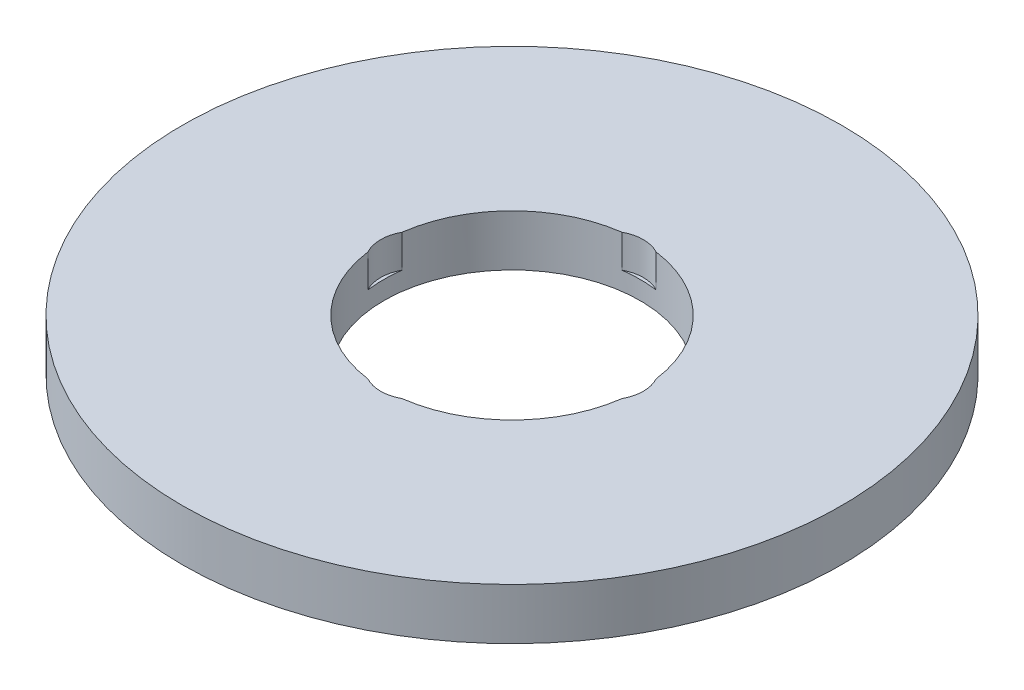
ISO-10303-21;
HEADER;
FILE_DESCRIPTION(('STEP AP214'),'2;1');
FILE_NAME('part.step','',(''),(''),'','','');
FILE_SCHEMA(('AUTOMOTIVE_DESIGN { 1 0 10303 214 1 1 1 1 }'));
ENDSEC;
DATA;
#1=APPLICATION_CONTEXT('core data for automotive mechanical design processes');
#2=APPLICATION_PROTOCOL_DEFINITION('international standard','automotive_design',2000,#1);
#3=PRODUCT_CONTEXT('',#1,'mechanical');
#4=PRODUCT('Part','Part','',(#3));
#5=PRODUCT_RELATED_PRODUCT_CATEGORY('part','',(#4));
#6=PRODUCT_DEFINITION_FORMATION('','',#4);
#7=PRODUCT_DEFINITION_CONTEXT('part definition',#1,'design');
#8=PRODUCT_DEFINITION('design','',#6,#7);
#9=PRODUCT_DEFINITION_SHAPE('','',#8);
#10=(LENGTH_UNIT() NAMED_UNIT(*) SI_UNIT(.MILLI.,.METRE.));
#11=(NAMED_UNIT(*) PLANE_ANGLE_UNIT() SI_UNIT($,.RADIAN.));
#12=(NAMED_UNIT(*) SI_UNIT($,.STERADIAN.) SOLID_ANGLE_UNIT());
#13=UNCERTAINTY_MEASURE_WITH_UNIT(LENGTH_MEASURE(1.E-05),#10,'distance_accuracy_value','');
#14=(GEOMETRIC_REPRESENTATION_CONTEXT(3) GLOBAL_UNCERTAINTY_ASSIGNED_CONTEXT((#13)) GLOBAL_UNIT_ASSIGNED_CONTEXT((#10,
#11,#12)) REPRESENTATION_CONTEXT('',''));
#15=CARTESIAN_POINT('',(0.,0.,0.));
#16=DIRECTION('',(0.,0.,1.));
#17=DIRECTION('',(1.,0.,0.));
#18=AXIS2_PLACEMENT_3D('',#15,#16,#17);
#19=CARTESIAN_POINT('',(0.,14.,0.));
#20=DIRECTION('',(0.,-1.,0.));
#21=DIRECTION('',(0.,0.,-1.));
#22=AXIS2_PLACEMENT_3D('',#19,#20,#21);
#23=CYLINDRICAL_SURFACE('',#22,90.);
#24=CARTESIAN_POINT('',(0.,14.,0.));
#25=DIRECTION('',(0.,1.,0.));
#26=DIRECTION('',(0.,0.,1.));
#27=AXIS2_PLACEMENT_3D('',#24,#25,#26);
#28=CIRCLE('',#27,90.);
#29=CARTESIAN_POINT('',(0.,14.,90.));
#30=VERTEX_POINT('',#29);
#31=EDGE_CURVE('E148',#30,#30,#28,.T.);
#32=ORIENTED_EDGE('',*,*,#31,.F.);
#33=EDGE_LOOP('',(#32));
#34=FACE_BOUND('',#33,.T.);
#35=CARTESIAN_POINT('',(0.,0.,0.));
#36=DIRECTION('',(0.,1.,0.));
#37=DIRECTION('',(0.,0.,1.));
#38=AXIS2_PLACEMENT_3D('',#35,#36,#37);
#39=CIRCLE('',#38,90.);
#40=CARTESIAN_POINT('',(0.,0.,90.));
#41=VERTEX_POINT('',#40);
#42=EDGE_CURVE('E139',#41,#41,#39,.T.);
#43=ORIENTED_EDGE('',*,*,#42,.T.);
#44=EDGE_LOOP('',(#43));
#45=FACE_BOUND('',#44,.T.);
#46=ADVANCED_FACE('F39',(#34,#45),#23,.T.);
#47=CARTESIAN_POINT('',(0.,14.,0.));
#48=DIRECTION('',(0.,1.,0.));
#49=DIRECTION('',(0.,0.,1.));
#50=AXIS2_PLACEMENT_3D('',#47,#48,#49);
#51=PLANE('',#50);
#52=CARTESIAN_POINT('',(0.,14.,25.9934029628675));
#53=DIRECTION('',(0.,1.,0.));
#54=DIRECTION('',(1.,0.,0.));
#55=AXIS2_PLACEMENT_3D('',#52,#53,#54);
#56=CIRCLE('',#55,9.87266587422507);
#57=CARTESIAN_POINT('',(-4.68158930757469,14.,34.6854828646684));
#58=VERTEX_POINT('',#57);
#59=CARTESIAN_POINT('',(4.68158930757494,14.,34.6854828646683));
#60=VERTEX_POINT('',#59);
#61=EDGE_CURVE('E175',#58,#60,#56,.T.);
#62=ORIENTED_EDGE('',*,*,#61,.F.);
#63=CARTESIAN_POINT('',(0.,14.,0.));
#64=DIRECTION('',(0.,1.,0.));
#65=DIRECTION('',(0.,0.,1.));
#66=AXIS2_PLACEMENT_3D('',#63,#64,#65);
#67=CIRCLE('',#66,35.);
#68=CARTESIAN_POINT('',(-34.6854828646684,14.,4.68158930757481));
#69=VERTEX_POINT('',#68);
#70=EDGE_CURVE('E134',#69,#58,#67,.T.);
#71=ORIENTED_EDGE('',*,*,#70,.F.);
#72=CARTESIAN_POINT('',(-25.9934029628675,14.,0.));
#73=DIRECTION('',(0.,1.,0.));
#74=DIRECTION('',(0.,0.,1.));
#75=AXIS2_PLACEMENT_3D('',#72,#73,#74);
#76=CIRCLE('',#75,9.87266587422507);
#77=CARTESIAN_POINT('',(-34.6854828646684,14.,-4.68158930757481));
#78=VERTEX_POINT('',#77);
#79=EDGE_CURVE('E143',#78,#69,#76,.T.);
#80=ORIENTED_EDGE('',*,*,#79,.F.);
#81=CARTESIAN_POINT('',(-4.68158930757518,14.,-34.6854828646683));
#82=VERTEX_POINT('',#81);
#83=EDGE_CURVE('E123',#82,#78,#67,.T.);
#84=ORIENTED_EDGE('',*,*,#83,.F.);
#85=CARTESIAN_POINT('',(-2.72266444133646E-13,14.,-25.9934029628675));
#86=DIRECTION('',(0.,1.,0.));
#87=DIRECTION('',(-1.,0.,0.));
#88=AXIS2_PLACEMENT_3D('',#85,#86,#87);
#89=CIRCLE('',#88,9.87266587422507);
#90=CARTESIAN_POINT('',(4.68158930757445,14.,-34.6854828646684));
#91=VERTEX_POINT('',#90);
#92=EDGE_CURVE('E106',#91,#82,#89,.T.);
#93=ORIENTED_EDGE('',*,*,#92,.F.);
#94=CARTESIAN_POINT('',(34.6854828646684,14.,-4.68158930757481));
#95=VERTEX_POINT('',#94);
#96=EDGE_CURVE('E125',#95,#91,#67,.T.);
#97=ORIENTED_EDGE('',*,*,#96,.F.);
#98=CARTESIAN_POINT('',(25.9934029628675,14.,0.));
#99=DIRECTION('',(0.,1.,0.));
#100=DIRECTION('',(0.,0.,-1.));
#101=AXIS2_PLACEMENT_3D('',#98,#99,#100);
#102=CIRCLE('',#101,9.87266587422507);
#103=CARTESIAN_POINT('',(34.6854828646684,14.,4.68158930757481));
#104=VERTEX_POINT('',#103);
#105=EDGE_CURVE('E286',#104,#95,#102,.T.);
#106=ORIENTED_EDGE('',*,*,#105,.F.);
#107=EDGE_CURVE('E135',#60,#104,#67,.T.);
#108=ORIENTED_EDGE('',*,*,#107,.F.);
#109=EDGE_LOOP('',(#62,#71,#80,#84,#93,#97,#106,#108));
#110=FACE_BOUND('',#109,.T.);
#111=ORIENTED_EDGE('',*,*,#31,.T.);
#112=EDGE_LOOP('',(#111));
#113=FACE_BOUND('',#112,.T.);
#114=ADVANCED_FACE('F118',(#110,#113),#51,.T.);
#115=CARTESIAN_POINT('',(0.,0.,0.));
#116=DIRECTION('',(0.,1.,0.));
#117=DIRECTION('',(0.,0.,1.));
#118=AXIS2_PLACEMENT_3D('',#115,#116,#117);
#119=PLANE('',#118);
#120=CARTESIAN_POINT('',(0.,0.,0.));
#121=DIRECTION('',(0.,1.,0.));
#122=DIRECTION('',(0.,0.,1.));
#123=AXIS2_PLACEMENT_3D('',#120,#121,#122);
#124=CIRCLE('',#123,35.);
#125=CARTESIAN_POINT('',(0.,0.,35.));
#126=VERTEX_POINT('',#125);
#127=EDGE_CURVE('E136',#126,#126,#124,.T.);
#128=ORIENTED_EDGE('',*,*,#127,.T.);
#129=EDGE_LOOP('',(#128));
#130=FACE_BOUND('',#129,.T.);
#131=ORIENTED_EDGE('',*,*,#42,.F.);
#132=EDGE_LOOP('',(#131));
#133=FACE_BOUND('',#132,.T.);
#134=ADVANCED_FACE('F187',(#130,#133),#119,.F.);
#135=CARTESIAN_POINT('',(0.,14.,0.));
#136=DIRECTION('',(0.,-1.,0.));
#137=DIRECTION('',(0.,0.,-1.));
#138=AXIS2_PLACEMENT_3D('',#135,#136,#137);
#139=CYLINDRICAL_SURFACE('',#138,35.);
#140=DIRECTION('',(0.,1.,0.));
#141=VECTOR('',#140,1.);
#142=CARTESIAN_POINT('',(-4.68158930757468,9.51405573248206,34.6854828646684));
#143=LINE('',#142,#141);
#144=CARTESIAN_POINT('',(-4.68158930757469,5.02811146496412,34.6854828646684));
#145=VERTEX_POINT('',#144);
#146=EDGE_CURVE('E11',#145,#58,#143,.T.);
#147=ORIENTED_EDGE('',*,*,#146,.F.);
#148=CARTESIAN_POINT('',(0.,5.02811146496412,0.));
#149=DIRECTION('',(0.,1.,0.));
#150=DIRECTION('',(0.,0.,1.));
#151=AXIS2_PLACEMENT_3D('',#148,#149,#150);
#152=CIRCLE('',#151,35.);
#153=CARTESIAN_POINT('',(4.68158930757494,5.02811146496412,34.6854828646683));
#154=VERTEX_POINT('',#153);
#155=EDGE_CURVE('E170',#145,#154,#152,.T.);
#156=ORIENTED_EDGE('',*,*,#155,.T.);
#157=DIRECTION('',(0.,1.,0.));
#158=VECTOR('',#157,1.);
#159=CARTESIAN_POINT('',(4.68158930757492,9.51405573248206,34.6854828646683));
#160=LINE('',#159,#158);
#161=EDGE_CURVE('E46',#60,#154,#160,.F.);
#162=ORIENTED_EDGE('',*,*,#161,.F.);
#163=ORIENTED_EDGE('',*,*,#107,.T.);
#164=DIRECTION('',(0.,1.,0.));
#165=VECTOR('',#164,1.);
#166=CARTESIAN_POINT('',(34.6854828646684,9.51405573248206,4.6815893075748));
#167=LINE('',#166,#165);
#168=CARTESIAN_POINT('',(34.6854828646684,5.02811146496412,4.68158930757481));
#169=VERTEX_POINT('',#168);
#170=EDGE_CURVE('E164',#169,#104,#167,.T.);
#171=ORIENTED_EDGE('',*,*,#170,.F.);
#172=CARTESIAN_POINT('',(0.,5.02811146496412,0.));
#173=DIRECTION('',(0.,1.,0.));
#174=DIRECTION('',(0.,0.,1.));
#175=AXIS2_PLACEMENT_3D('',#172,#173,#174);
#176=CIRCLE('',#175,35.);
#177=CARTESIAN_POINT('',(34.6854828646684,5.02811146496412,-4.68158930757481));
#178=VERTEX_POINT('',#177);
#179=EDGE_CURVE('E115',#169,#178,#176,.T.);
#180=ORIENTED_EDGE('',*,*,#179,.T.);
#181=DIRECTION('',(0.,1.,0.));
#182=VECTOR('',#181,1.);
#183=CARTESIAN_POINT('',(34.6854828646684,9.51405573248206,-4.6815893075748));
#184=LINE('',#183,#182);
#185=EDGE_CURVE('E131',#95,#178,#184,.F.);
#186=ORIENTED_EDGE('',*,*,#185,.F.);
#187=ORIENTED_EDGE('',*,*,#96,.T.);
#188=DIRECTION('',(0.,1.,0.));
#189=VECTOR('',#188,1.);
#190=CARTESIAN_POINT('',(4.68158930757444,9.51405573248206,-34.6854828646684));
#191=LINE('',#190,#189);
#192=CARTESIAN_POINT('',(4.68158930757445,5.02811146496412,-34.6854828646684));
#193=VERTEX_POINT('',#192);
#194=EDGE_CURVE('E105',#193,#91,#191,.T.);
#195=ORIENTED_EDGE('',*,*,#194,.F.);
#196=CARTESIAN_POINT('',(0.,5.02811146496412,0.));
#197=DIRECTION('',(0.,1.,0.));
#198=DIRECTION('',(0.,0.,1.));
#199=AXIS2_PLACEMENT_3D('',#196,#197,#198);
#200=CIRCLE('',#199,35.);
#201=CARTESIAN_POINT('',(-4.68158930757518,5.02811146496412,-34.6854828646683));
#202=VERTEX_POINT('',#201);
#203=EDGE_CURVE('E159',#193,#202,#200,.T.);
#204=ORIENTED_EDGE('',*,*,#203,.T.);
#205=DIRECTION('',(0.,1.,0.));
#206=VECTOR('',#205,1.);
#207=CARTESIAN_POINT('',(-4.68158930757516,9.51405573248206,-34.6854828646683));
#208=LINE('',#207,#206);
#209=EDGE_CURVE('E114',#82,#202,#208,.F.);
#210=ORIENTED_EDGE('',*,*,#209,.F.);
#211=ORIENTED_EDGE('',*,*,#83,.T.);
#212=DIRECTION('',(0.,1.,0.));
#213=VECTOR('',#212,1.);
#214=CARTESIAN_POINT('',(-34.6854828646684,9.51405573248206,-4.6815893075748));
#215=LINE('',#214,#213);
#216=CARTESIAN_POINT('',(-34.6854828646684,5.02811146496412,-4.68158930757481));
#217=VERTEX_POINT('',#216);
#218=EDGE_CURVE('E160',#217,#78,#215,.T.);
#219=ORIENTED_EDGE('',*,*,#218,.F.);
#220=CARTESIAN_POINT('',(0.,5.02811146496412,0.));
#221=DIRECTION('',(0.,1.,0.));
#222=DIRECTION('',(0.,0.,1.));
#223=AXIS2_PLACEMENT_3D('',#220,#221,#222);
#224=CIRCLE('',#223,35.);
#225=CARTESIAN_POINT('',(-34.6854828646684,5.02811146496412,4.68158930757481));
#226=VERTEX_POINT('',#225);
#227=EDGE_CURVE('E149',#217,#226,#224,.T.);
#228=ORIENTED_EDGE('',*,*,#227,.T.);
#229=DIRECTION('',(0.,1.,0.));
#230=VECTOR('',#229,1.);
#231=CARTESIAN_POINT('',(-34.6854828646684,9.51405573248206,4.6815893075748));
#232=LINE('',#231,#230);
#233=EDGE_CURVE('E152',#69,#226,#232,.F.);
#234=ORIENTED_EDGE('',*,*,#233,.F.);
#235=ORIENTED_EDGE('',*,*,#70,.T.);
#236=EDGE_LOOP('',(#147,#156,#162,#163,#171,#180,#186,#187,#195,#204,#210,#211,#219,#228,#234,#235));
#237=FACE_BOUND('',#236,.T.);
#238=ORIENTED_EDGE('',*,*,#127,.F.);
#239=EDGE_LOOP('',(#238));
#240=FACE_BOUND('',#239,.T.);
#241=ADVANCED_FACE('F126',(#237,#240),#139,.F.);
#242=CARTESIAN_POINT('',(-25.9934029628675,5.02811146496412,0.));
#243=DIRECTION('',(0.,1.,0.));
#244=DIRECTION('',(0.,0.,1.));
#245=AXIS2_PLACEMENT_3D('',#242,#243,#244);
#246=CYLINDRICAL_SURFACE('',#245,9.87266587422507);
#247=ORIENTED_EDGE('',*,*,#218,.T.);
#248=ORIENTED_EDGE('',*,*,#79,.T.);
#249=ORIENTED_EDGE('',*,*,#233,.T.);
#250=CARTESIAN_POINT('',(-25.9934029628675,5.02811146496412,0.));
#251=DIRECTION('',(0.,1.,0.));
#252=DIRECTION('',(0.,0.,1.));
#253=AXIS2_PLACEMENT_3D('',#250,#251,#252);
#254=CIRCLE('',#253,9.87266587422507);
#255=EDGE_CURVE('E144',#217,#226,#254,.T.);
#256=ORIENTED_EDGE('',*,*,#255,.F.);
#257=EDGE_LOOP('',(#247,#248,#249,#256));
#258=FACE_BOUND('',#257,.T.);
#259=ADVANCED_FACE('F200',(#258),#246,.F.);
#260=CARTESIAN_POINT('',(-25.9934029628675,5.02811146496412,0.));
#261=DIRECTION('',(0.,1.,0.));
#262=DIRECTION('',(0.,0.,1.));
#263=AXIS2_PLACEMENT_3D('',#260,#261,#262);
#264=PLANE('',#263);
#265=ORIENTED_EDGE('',*,*,#255,.T.);
#266=ORIENTED_EDGE('',*,*,#227,.F.);
#267=EDGE_LOOP('',(#265,#266));
#268=FACE_BOUND('',#267,.T.);
#269=ADVANCED_FACE('F201',(#268),#264,.T.);
#270=CARTESIAN_POINT('',(-2.72266444133646E-13,5.02811146496412,-25.9934029628675));
#271=DIRECTION('',(0.,1.,0.));
#272=DIRECTION('',(0.,0.,1.));
#273=AXIS2_PLACEMENT_3D('',#270,#271,#272);
#274=CYLINDRICAL_SURFACE('',#273,9.87266587422507);
#275=ORIENTED_EDGE('',*,*,#194,.T.);
#276=ORIENTED_EDGE('',*,*,#92,.T.);
#277=ORIENTED_EDGE('',*,*,#209,.T.);
#278=CARTESIAN_POINT('',(-2.72266444133646E-13,5.02811146496412,-25.9934029628675));
#279=DIRECTION('',(0.,1.,0.));
#280=DIRECTION('',(-1.,0.,0.));
#281=AXIS2_PLACEMENT_3D('',#278,#279,#280);
#282=CIRCLE('',#281,9.87266587422507);
#283=EDGE_CURVE('E107',#193,#202,#282,.T.);
#284=ORIENTED_EDGE('',*,*,#283,.F.);
#285=EDGE_LOOP('',(#275,#276,#277,#284));
#286=FACE_BOUND('',#285,.T.);
#287=ADVANCED_FACE('F102',(#286),#274,.F.);
#288=CARTESIAN_POINT('',(-2.72266444133646E-13,5.02811146496412,-25.9934029628675));
#289=DIRECTION('',(0.,1.,0.));
#290=DIRECTION('',(-1.,0.,0.));
#291=AXIS2_PLACEMENT_3D('',#288,#289,#290);
#292=PLANE('',#291);
#293=ORIENTED_EDGE('',*,*,#283,.T.);
#294=ORIENTED_EDGE('',*,*,#203,.F.);
#295=EDGE_LOOP('',(#293,#294));
#296=FACE_BOUND('',#295,.T.);
#297=ADVANCED_FACE('F209',(#296),#292,.T.);
#298=CARTESIAN_POINT('',(25.9934029628675,5.02811146496412,0.));
#299=DIRECTION('',(0.,1.,0.));
#300=DIRECTION('',(0.,0.,1.));
#301=AXIS2_PLACEMENT_3D('',#298,#299,#300);
#302=CYLINDRICAL_SURFACE('',#301,9.87266587422507);
#303=ORIENTED_EDGE('',*,*,#170,.T.);
#304=ORIENTED_EDGE('',*,*,#105,.T.);
#305=ORIENTED_EDGE('',*,*,#185,.T.);
#306=CARTESIAN_POINT('',(25.9934029628675,5.02811146496412,0.));
#307=DIRECTION('',(0.,1.,0.));
#308=DIRECTION('',(0.,0.,-1.));
#309=AXIS2_PLACEMENT_3D('',#306,#307,#308);
#310=CIRCLE('',#309,9.87266587422507);
#311=EDGE_CURVE('E56',#169,#178,#310,.T.);
#312=ORIENTED_EDGE('',*,*,#311,.F.);
#313=EDGE_LOOP('',(#303,#304,#305,#312));
#314=FACE_BOUND('',#313,.T.);
#315=ADVANCED_FACE('F213',(#314),#302,.F.);
#316=CARTESIAN_POINT('',(25.9934029628675,5.02811146496412,0.));
#317=DIRECTION('',(0.,1.,0.));
#318=DIRECTION('',(0.,0.,-1.));
#319=AXIS2_PLACEMENT_3D('',#316,#317,#318);
#320=PLANE('',#319);
#321=ORIENTED_EDGE('',*,*,#311,.T.);
#322=ORIENTED_EDGE('',*,*,#179,.F.);
#323=EDGE_LOOP('',(#321,#322));
#324=FACE_BOUND('',#323,.T.);
#325=ADVANCED_FACE('F179',(#324),#320,.T.);
#326=CARTESIAN_POINT('',(0.,5.02811146496412,25.9934029628675));
#327=DIRECTION('',(0.,1.,0.));
#328=DIRECTION('',(0.,0.,1.));
#329=AXIS2_PLACEMENT_3D('',#326,#327,#328);
#330=CYLINDRICAL_SURFACE('',#329,9.87266587422507);
#331=ORIENTED_EDGE('',*,*,#146,.T.);
#332=ORIENTED_EDGE('',*,*,#61,.T.);
#333=ORIENTED_EDGE('',*,*,#161,.T.);
#334=CARTESIAN_POINT('',(0.,5.02811146496412,25.9934029628675));
#335=DIRECTION('',(0.,1.,0.));
#336=DIRECTION('',(1.,0.,0.));
#337=AXIS2_PLACEMENT_3D('',#334,#335,#336);
#338=CIRCLE('',#337,9.87266587422507);
#339=EDGE_CURVE('E55',#145,#154,#338,.T.);
#340=ORIENTED_EDGE('',*,*,#339,.F.);
#341=EDGE_LOOP('',(#331,#332,#333,#340));
#342=FACE_BOUND('',#341,.T.);
#343=ADVANCED_FACE('F171',(#342),#330,.F.);
#344=CARTESIAN_POINT('',(0.,5.02811146496412,25.9934029628675));
#345=DIRECTION('',(0.,1.,0.));
#346=DIRECTION('',(1.,0.,0.));
#347=AXIS2_PLACEMENT_3D('',#344,#345,#346);
#348=PLANE('',#347);
#349=ORIENTED_EDGE('',*,*,#339,.T.);
#350=ORIENTED_EDGE('',*,*,#155,.F.);
#351=EDGE_LOOP('',(#349,#350));
#352=FACE_BOUND('',#351,.T.);
#353=ADVANCED_FACE('F173',(#352),#348,.T.);
#354=CLOSED_SHELL('',(#46,#114,#134,#241,#259,#269,#287,#297,#315,#325,#343,#353));
#355=MANIFOLD_SOLID_BREP('B2',#354);
#356=ADVANCED_BREP_SHAPE_REPRESENTATION('',(#18,#355),#14);
#357=SHAPE_DEFINITION_REPRESENTATION(#9,#356);
ENDSEC;
END-ISO-10303-21;
